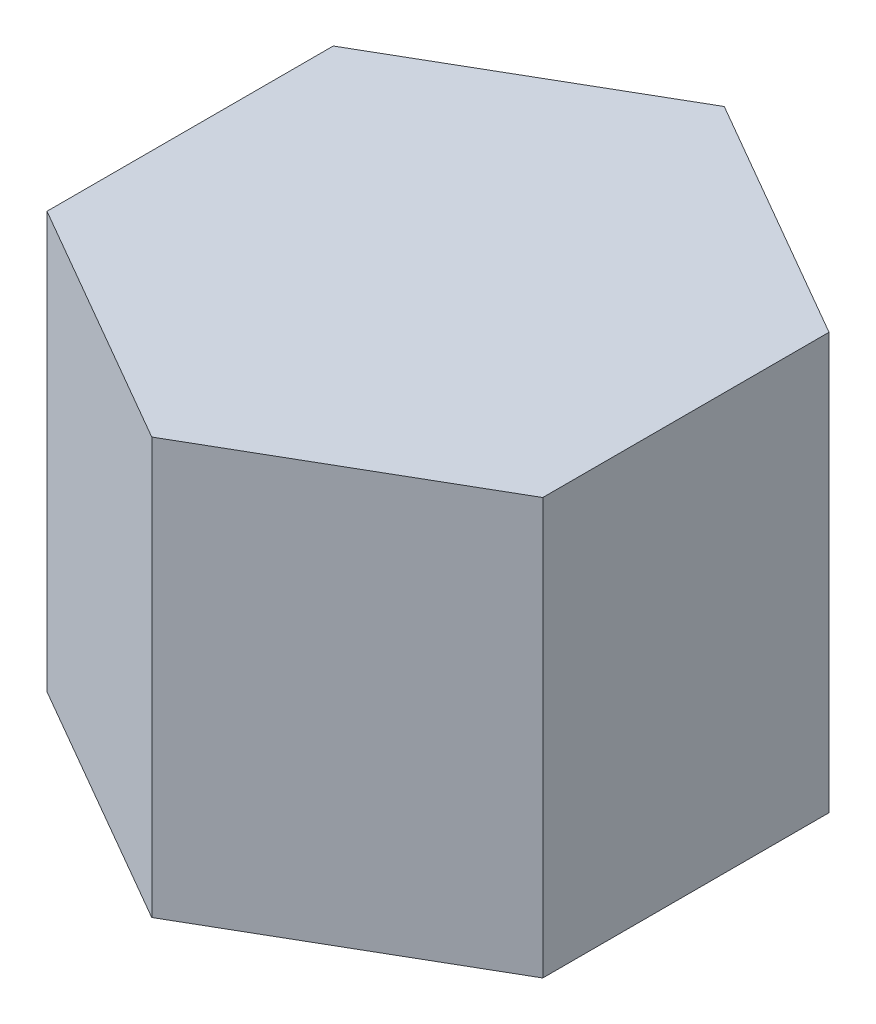
ISO-10303-21;
HEADER;
FILE_DESCRIPTION(('STEP AP214'),'2;1');
FILE_NAME('part.step','',(''),(''),'','','');
FILE_SCHEMA(('AUTOMOTIVE_DESIGN { 1 0 10303 214 1 1 1 1 }'));
ENDSEC;
DATA;
#1=APPLICATION_CONTEXT('core data for automotive mechanical design processes');
#2=APPLICATION_PROTOCOL_DEFINITION('international standard','automotive_design',2000,#1);
#3=PRODUCT_CONTEXT('',#1,'mechanical');
#4=PRODUCT('Part','Part','',(#3));
#5=PRODUCT_RELATED_PRODUCT_CATEGORY('part','',(#4));
#6=PRODUCT_DEFINITION_FORMATION('','',#4);
#7=PRODUCT_DEFINITION_CONTEXT('part definition',#1,'design');
#8=PRODUCT_DEFINITION('design','',#6,#7);
#9=PRODUCT_DEFINITION_SHAPE('','',#8);
#10=(LENGTH_UNIT() NAMED_UNIT(*) SI_UNIT(.MILLI.,.METRE.));
#11=(NAMED_UNIT(*) PLANE_ANGLE_UNIT() SI_UNIT($,.RADIAN.));
#12=(NAMED_UNIT(*) SI_UNIT($,.STERADIAN.) SOLID_ANGLE_UNIT());
#13=UNCERTAINTY_MEASURE_WITH_UNIT(LENGTH_MEASURE(1.E-05),#10,'distance_accuracy_value','');
#14=(GEOMETRIC_REPRESENTATION_CONTEXT(3) GLOBAL_UNCERTAINTY_ASSIGNED_CONTEXT((#13)) GLOBAL_UNIT_ASSIGNED_CONTEXT((#10,
#11,#12)) REPRESENTATION_CONTEXT('',''));
#15=CARTESIAN_POINT('',(0.,0.,0.));
#16=DIRECTION('',(0.,0.,1.));
#17=DIRECTION('',(1.,0.,0.));
#18=AXIS2_PLACEMENT_3D('',#15,#16,#17);
#19=CARTESIAN_POINT('',(204.839551417382,-147.556598747966,292.547996624279));
#20=DIRECTION('',(-0.500000000000096,0.,-0.866025403784383));
#21=DIRECTION('',(-0.866025403784383,0.,0.500000000000096));
#22=AXIS2_PLACEMENT_3D('',#19,#20,#21);
#23=PLANE('',#22);
#24=CARTESIAN_POINT('',(205.142660308706,-147.047793579175,292.372996624279));
#25=DIRECTION('',(-0.866025403784383,0.,0.500000000000096));
#26=VECTOR('',#25,1.);
#27=LINE('',#24,#26);
#28=CARTESIAN_POINT('',(205.142660308706,-147.047793579175,292.372996624279));
#29=VERTEX_POINT('',#28);
#30=CARTESIAN_POINT('',(204.839551417382,-147.047793579175,292.547996624279));
#31=VERTEX_POINT('',#30);
#32=EDGE_CURVE('E170',#29,#31,#27,.T.);
#33=ORIENTED_EDGE('',*,*,#32,.T.);
#34=CARTESIAN_POINT('',(204.839551417382,-147.556598747966,292.547996624279));
#35=DIRECTION('',(0.,1.,0.));
#36=VECTOR('',#35,1.);
#37=LINE('',#34,#36);
#38=CARTESIAN_POINT('',(204.839551417382,-147.556598747966,292.547996624279));
#39=VERTEX_POINT('',#38);
#40=EDGE_CURVE('E35',#39,#31,#37,.T.);
#41=ORIENTED_EDGE('',*,*,#40,.F.);
#42=CARTESIAN_POINT('',(205.142660308706,-147.556598747966,292.372996624279));
#43=DIRECTION('',(-0.866025403784383,0.,0.500000000000096));
#44=VECTOR('',#43,1.);
#45=LINE('',#42,#44);
#46=CARTESIAN_POINT('',(205.142660308706,-147.556598747966,292.372996624279));
#47=VERTEX_POINT('',#46);
#48=EDGE_CURVE('E159',#47,#39,#45,.T.);
#49=ORIENTED_EDGE('',*,*,#48,.F.);
#50=CARTESIAN_POINT('',(205.142660308706,-147.556598747966,292.372996624279));
#51=DIRECTION('',(0.,1.,0.));
#52=VECTOR('',#51,1.);
#53=LINE('',#50,#52);
#54=EDGE_CURVE('E10',#47,#29,#53,.T.);
#55=ORIENTED_EDGE('',*,*,#54,.T.);
#56=EDGE_LOOP('',(#33,#41,#49,#55));
#57=FACE_BOUND('',#56,.T.);
#58=ADVANCED_FACE('F16',(#57),#23,.F.);
#59=CARTESIAN_POINT('',(205.142660308706,-147.556598747966,291.594471220494));
#60=DIRECTION('',(-1.,0.,0.));
#61=DIRECTION('',(0.,-1.,0.));
#62=AXIS2_PLACEMENT_3D('',#59,#60,#61);
#63=PLANE('',#62);
#64=CARTESIAN_POINT('',(205.142660308706,-147.047793579175,292.022996624279));
#65=DIRECTION('',(0.,0.,1.));
#66=VECTOR('',#65,1.);
#67=LINE('',#64,#66);
#68=CARTESIAN_POINT('',(205.142660308706,-147.047793579175,292.022996624279));
#69=VERTEX_POINT('',#68);
#70=EDGE_CURVE('E167',#69,#29,#67,.T.);
#71=ORIENTED_EDGE('',*,*,#70,.T.);
#72=ORIENTED_EDGE('',*,*,#54,.F.);
#73=CARTESIAN_POINT('',(205.142660308706,-147.556598747966,292.022996624279));
#74=DIRECTION('',(0.,0.,1.));
#75=VECTOR('',#74,1.);
#76=LINE('',#73,#75);
#77=CARTESIAN_POINT('',(205.142660308706,-147.556598747966,292.022996624279));
#78=VERTEX_POINT('',#77);
#79=EDGE_CURVE('E156',#78,#47,#76,.T.);
#80=ORIENTED_EDGE('',*,*,#79,.F.);
#81=CARTESIAN_POINT('',(205.142660308706,-147.556598747966,292.022996624279));
#82=DIRECTION('',(0.,1.,0.));
#83=VECTOR('',#82,1.);
#84=LINE('',#81,#83);
#85=EDGE_CURVE('E27',#78,#69,#84,.T.);
#86=ORIENTED_EDGE('',*,*,#85,.T.);
#87=EDGE_LOOP('',(#71,#72,#80,#86));
#88=FACE_BOUND('',#87,.T.);
#89=ADVANCED_FACE('F189',(#88),#63,.F.);
#90=CARTESIAN_POINT('',(205.142660308706,-147.556598747966,292.022996624279));
#91=DIRECTION('',(-0.500000000000062,0.,0.866025403784403));
#92=DIRECTION('',(0.866025403784403,0.,0.500000000000062));
#93=AXIS2_PLACEMENT_3D('',#90,#91,#92);
#94=PLANE('',#93);
#95=CARTESIAN_POINT('',(204.839551417381,-147.047793579175,291.847996624279));
#96=DIRECTION('',(0.866025403784403,0.,0.500000000000062));
#97=VECTOR('',#96,1.);
#98=LINE('',#95,#97);
#99=CARTESIAN_POINT('',(204.839551417382,-147.047793579175,291.847996624279));
#100=VERTEX_POINT('',#99);
#101=EDGE_CURVE('E163',#100,#69,#98,.T.);
#102=ORIENTED_EDGE('',*,*,#101,.T.);
#103=ORIENTED_EDGE('',*,*,#85,.F.);
#104=CARTESIAN_POINT('',(204.839551417381,-147.556598747966,291.847996624279));
#105=DIRECTION('',(0.866025403784403,0.,0.500000000000062));
#106=VECTOR('',#105,1.);
#107=LINE('',#104,#106);
#108=CARTESIAN_POINT('',(204.839551417382,-147.556598747966,291.847996624279));
#109=VERTEX_POINT('',#108);
#110=EDGE_CURVE('E106',#109,#78,#107,.T.);
#111=ORIENTED_EDGE('',*,*,#110,.F.);
#112=CARTESIAN_POINT('',(204.839551417381,-147.556598747966,291.847996624279));
#113=DIRECTION('',(0.,1.,0.));
#114=VECTOR('',#113,1.);
#115=LINE('',#112,#114);
#116=EDGE_CURVE('E94',#109,#100,#115,.T.);
#117=ORIENTED_EDGE('',*,*,#116,.T.);
#118=EDGE_LOOP('',(#102,#103,#111,#117));
#119=FACE_BOUND('',#118,.T.);
#120=ADVANCED_FACE('F198',(#119),#94,.F.);
#121=CARTESIAN_POINT('',(204.839551417382,-147.556598747966,291.847996624279));
#122=DIRECTION('',(0.500000000000062,0.,0.866025403784403));
#123=DIRECTION('',(0.866025403784403,0.,-0.500000000000062));
#124=AXIS2_PLACEMENT_3D('',#121,#122,#123);
#125=PLANE('',#124);
#126=CARTESIAN_POINT('',(204.536442526057,-147.047793579175,292.022996624279));
#127=DIRECTION('',(0.866025403784403,0.,-0.500000000000062));
#128=VECTOR('',#127,1.);
#129=LINE('',#126,#128);
#130=CARTESIAN_POINT('',(204.536442526057,-147.047793579175,292.022996624279));
#131=VERTEX_POINT('',#130);
#132=EDGE_CURVE('E162',#131,#100,#129,.T.);
#133=ORIENTED_EDGE('',*,*,#132,.T.);
#134=ORIENTED_EDGE('',*,*,#116,.F.);
#135=CARTESIAN_POINT('',(204.536442526057,-147.556598747966,292.022996624279));
#136=DIRECTION('',(0.866025403784403,0.,-0.500000000000062));
#137=VECTOR('',#136,1.);
#138=LINE('',#135,#137);
#139=CARTESIAN_POINT('',(204.536442526057,-147.556598747966,292.022996624279));
#140=VERTEX_POINT('',#139);
#141=EDGE_CURVE('E98',#140,#109,#138,.T.);
#142=ORIENTED_EDGE('',*,*,#141,.F.);
#143=CARTESIAN_POINT('',(204.536442526057,-147.556598747966,292.022996624279));
#144=DIRECTION('',(0.,1.,0.));
#145=VECTOR('',#144,1.);
#146=LINE('',#143,#145);
#147=EDGE_CURVE('E79',#140,#131,#146,.T.);
#148=ORIENTED_EDGE('',*,*,#147,.T.);
#149=EDGE_LOOP('',(#133,#134,#142,#148));
#150=FACE_BOUND('',#149,.T.);
#151=ADVANCED_FACE('F100',(#150),#125,.F.);
#152=CARTESIAN_POINT('',(204.536442526057,-147.556598747966,291.594471220494));
#153=DIRECTION('',(1.,0.,0.));
#154=DIRECTION('',(0.,1.,0.));
#155=AXIS2_PLACEMENT_3D('',#152,#153,#154);
#156=PLANE('',#155);
#157=CARTESIAN_POINT('',(204.536442526057,-147.047793579175,292.372996624279));
#158=DIRECTION('',(0.,0.,-1.));
#159=VECTOR('',#158,1.);
#160=LINE('',#157,#159);
#161=CARTESIAN_POINT('',(204.536442526057,-147.047793579175,292.372996624279));
#162=VERTEX_POINT('',#161);
#163=EDGE_CURVE('E88',#162,#131,#160,.T.);
#164=ORIENTED_EDGE('',*,*,#163,.T.);
#165=ORIENTED_EDGE('',*,*,#147,.F.);
#166=CARTESIAN_POINT('',(204.536442526057,-147.556598747966,292.372996624279));
#167=DIRECTION('',(0.,0.,-1.));
#168=VECTOR('',#167,1.);
#169=LINE('',#166,#168);
#170=CARTESIAN_POINT('',(204.536442526057,-147.556598747966,292.372996624279));
#171=VERTEX_POINT('',#170);
#172=EDGE_CURVE('E84',#171,#140,#169,.T.);
#173=ORIENTED_EDGE('',*,*,#172,.F.);
#174=CARTESIAN_POINT('',(204.536442526057,-147.556598747966,292.372996624279));
#175=DIRECTION('',(0.,1.,0.));
#176=VECTOR('',#175,1.);
#177=LINE('',#174,#176);
#178=EDGE_CURVE('E58',#171,#162,#177,.T.);
#179=ORIENTED_EDGE('',*,*,#178,.T.);
#180=EDGE_LOOP('',(#164,#165,#173,#179));
#181=FACE_BOUND('',#180,.T.);
#182=ADVANCED_FACE('F82',(#181),#156,.F.);
#183=CARTESIAN_POINT('',(204.536442526057,-147.556598747966,292.372996624279));
#184=DIRECTION('',(0.500000000000062,0.,-0.866025403784403));
#185=DIRECTION('',(-0.866025403784403,0.,-0.500000000000062));
#186=AXIS2_PLACEMENT_3D('',#183,#184,#185);
#187=PLANE('',#186);
#188=CARTESIAN_POINT('',(204.839551417382,-147.047793579175,292.547996624279));
#189=DIRECTION('',(-0.866025403784403,0.,-0.500000000000062));
#190=VECTOR('',#189,1.);
#191=LINE('',#188,#190);
#192=EDGE_CURVE('E160',#31,#162,#191,.T.);
#193=ORIENTED_EDGE('',*,*,#192,.T.);
#194=ORIENTED_EDGE('',*,*,#178,.F.);
#195=CARTESIAN_POINT('',(204.839551417382,-147.556598747966,292.547996624279));
#196=DIRECTION('',(-0.866025403784403,0.,-0.500000000000062));
#197=VECTOR('',#196,1.);
#198=LINE('',#195,#197);
#199=EDGE_CURVE('E112',#39,#171,#198,.T.);
#200=ORIENTED_EDGE('',*,*,#199,.F.);
#201=ORIENTED_EDGE('',*,*,#40,.T.);
#202=EDGE_LOOP('',(#193,#194,#200,#201));
#203=FACE_BOUND('',#202,.T.);
#204=ADVANCED_FACE('F131',(#203),#187,.F.);
#205=CARTESIAN_POINT('',(206.491105863044,-147.556598747966,291.594471220494));
#206=DIRECTION('',(0.,1.,0.));
#207=DIRECTION('',(-1.,0.,0.));
#208=AXIS2_PLACEMENT_3D('',#205,#206,#207);
#209=PLANE('',#208);
#210=ORIENTED_EDGE('',*,*,#48,.T.);
#211=ORIENTED_EDGE('',*,*,#199,.T.);
#212=ORIENTED_EDGE('',*,*,#172,.T.);
#213=ORIENTED_EDGE('',*,*,#141,.T.);
#214=ORIENTED_EDGE('',*,*,#110,.T.);
#215=ORIENTED_EDGE('',*,*,#79,.T.);
#216=EDGE_LOOP('',(#210,#211,#212,#213,#214,#215));
#217=FACE_BOUND('',#216,.T.);
#218=ADVANCED_FACE('F111',(#217),#209,.F.);
#219=CARTESIAN_POINT('',(206.491105863044,-147.047793579175,291.594471220494));
#220=DIRECTION('',(0.,1.,0.));
#221=DIRECTION('',(-1.,0.,0.));
#222=AXIS2_PLACEMENT_3D('',#219,#220,#221);
#223=PLANE('',#222);
#224=ORIENTED_EDGE('',*,*,#32,.F.);
#225=ORIENTED_EDGE('',*,*,#70,.F.);
#226=ORIENTED_EDGE('',*,*,#101,.F.);
#227=ORIENTED_EDGE('',*,*,#132,.F.);
#228=ORIENTED_EDGE('',*,*,#163,.F.);
#229=ORIENTED_EDGE('',*,*,#192,.F.);
#230=EDGE_LOOP('',(#224,#225,#226,#227,#228,#229));
#231=FACE_BOUND('',#230,.T.);
#232=ADVANCED_FACE('F130',(#231),#223,.T.);
#233=CLOSED_SHELL('',(#58,#89,#120,#151,#182,#204,#218,#232));
#234=MANIFOLD_SOLID_BREP('B1',#233);
#235=ADVANCED_BREP_SHAPE_REPRESENTATION('',(#18,#234),#14);
#236=SHAPE_DEFINITION_REPRESENTATION(#9,#235);
ENDSEC;
END-ISO-10303-21;
